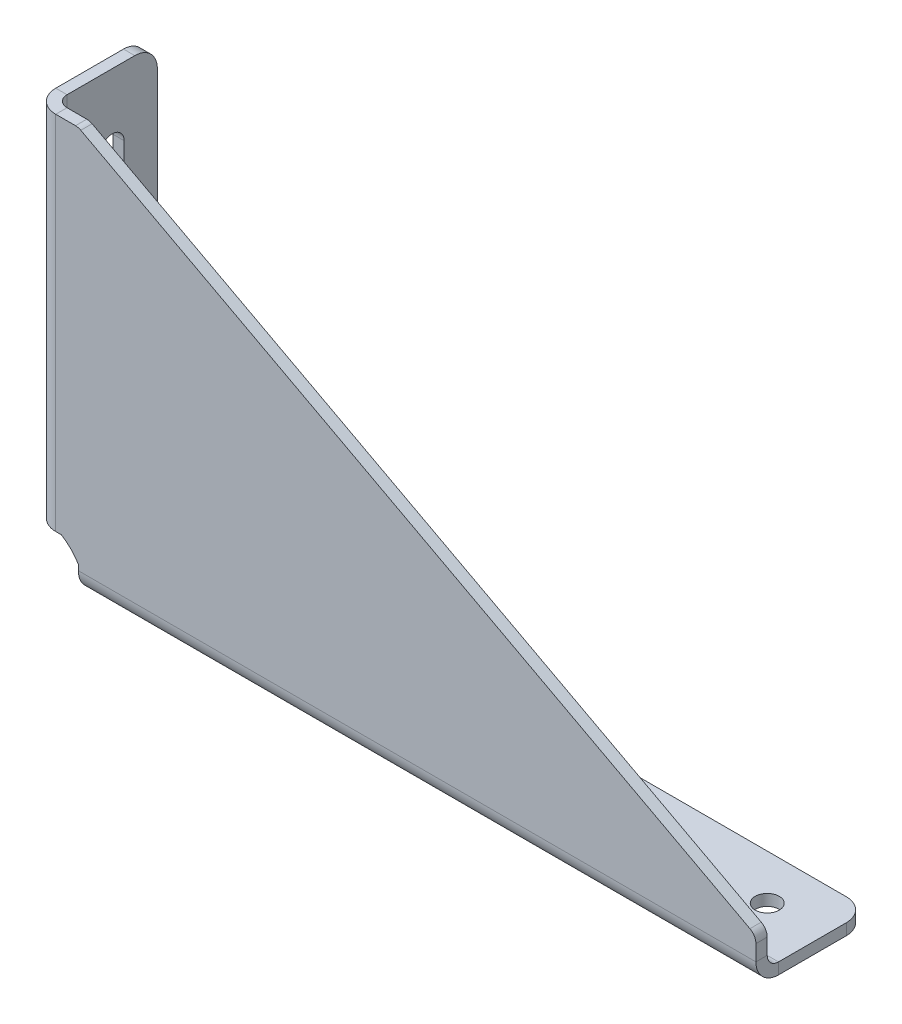
ISO-10303-21;
HEADER;
FILE_DESCRIPTION(('STEP AP214'),'2;1');
FILE_NAME('part.step','',(''),(''),'','','');
FILE_SCHEMA(('AUTOMOTIVE_DESIGN { 1 0 10303 214 1 1 1 1 }'));
ENDSEC;
DATA;
#1=APPLICATION_CONTEXT('core data for automotive mechanical design processes');
#2=APPLICATION_PROTOCOL_DEFINITION('international standard','automotive_design',2000,#1);
#3=PRODUCT_CONTEXT('',#1,'mechanical');
#4=PRODUCT('Part','Part','',(#3));
#5=PRODUCT_RELATED_PRODUCT_CATEGORY('part','',(#4));
#6=PRODUCT_DEFINITION_FORMATION('','',#4);
#7=PRODUCT_DEFINITION_CONTEXT('part definition',#1,'design');
#8=PRODUCT_DEFINITION('design','',#6,#7);
#9=PRODUCT_DEFINITION_SHAPE('','',#8);
#10=(LENGTH_UNIT() NAMED_UNIT(*) SI_UNIT(.MILLI.,.METRE.));
#11=(NAMED_UNIT(*) PLANE_ANGLE_UNIT() SI_UNIT($,.RADIAN.));
#12=(NAMED_UNIT(*) SI_UNIT($,.STERADIAN.) SOLID_ANGLE_UNIT());
#13=UNCERTAINTY_MEASURE_WITH_UNIT(LENGTH_MEASURE(1.E-05),#10,'distance_accuracy_value','');
#14=(GEOMETRIC_REPRESENTATION_CONTEXT(3) GLOBAL_UNCERTAINTY_ASSIGNED_CONTEXT((#13)) GLOBAL_UNIT_ASSIGNED_CONTEXT((#10,
#11,#12)) REPRESENTATION_CONTEXT('',''));
#15=CARTESIAN_POINT('',(0.,0.,0.));
#16=DIRECTION('',(0.,0.,1.));
#17=DIRECTION('',(1.,0.,0.));
#18=AXIS2_PLACEMENT_3D('',#15,#16,#17);
#19=CARTESIAN_POINT('',(0.,0.,3.175));
#20=DIRECTION('',(0.,0.,1.));
#21=DIRECTION('',(-1.,0.,0.));
#22=AXIS2_PLACEMENT_3D('',#19,#20,#21);
#23=PLANE('',#22);
#24=DIRECTION('',(-1.,0.,0.));
#25=VECTOR('',#24,1.);
#26=CARTESIAN_POINT('',(0.,114.3,3.175));
#27=LINE('',#26,#25);
#28=CARTESIAN_POINT('',(11.90625,114.3,3.175));
#29=VERTEX_POINT('',#28);
#30=CARTESIAN_POINT('',(6.35,114.3,3.175));
#31=VERTEX_POINT('',#30);
#32=EDGE_CURVE('E503',#29,#31,#27,.T.);
#33=ORIENTED_EDGE('',*,*,#32,.T.);
#34=DIRECTION('',(0.,-1.,0.));
#35=VECTOR('',#34,1.);
#36=CARTESIAN_POINT('',(6.35,12.7,3.17500000000001));
#37=LINE('',#36,#35);
#38=CARTESIAN_POINT('',(6.35,12.7,3.17500000000001));
#39=VERTEX_POINT('',#38);
#40=EDGE_CURVE('E415',#39,#31,#37,.F.);
#41=ORIENTED_EDGE('',*,*,#40,.F.);
#42=DIRECTION('',(-1.,0.,0.));
#43=VECTOR('',#42,1.);
#44=CARTESIAN_POINT('',(0.,12.7,3.175));
#45=LINE('',#44,#43);
#46=CARTESIAN_POINT('',(7.93749999999999,12.7,3.175));
#47=VERTEX_POINT('',#46);
#48=EDGE_CURVE('E490',#47,#39,#45,.T.);
#49=ORIENTED_EDGE('',*,*,#48,.F.);
#50=CARTESIAN_POINT('',(0.,0.,3.175));
#51=DIRECTION('',(0.,0.,1.));
#52=DIRECTION('',(1.,0.,0.));
#53=AXIS2_PLACEMENT_3D('',#50,#51,#52);
#54=CIRCLE('',#53,14.9764450471398);
#55=CARTESIAN_POINT('',(12.7,7.9375,3.175));
#56=VERTEX_POINT('',#55);
#57=EDGE_CURVE('E363',#56,#47,#54,.T.);
#58=ORIENTED_EDGE('',*,*,#57,.F.);
#59=DIRECTION('',(0.,1.,0.));
#60=VECTOR('',#59,1.);
#61=CARTESIAN_POINT('',(12.7,0.,3.175));
#62=LINE('',#61,#60);
#63=CARTESIAN_POINT('',(12.7,6.34999999999997,3.175));
#64=VERTEX_POINT('',#63);
#65=EDGE_CURVE('E498',#64,#56,#62,.T.);
#66=ORIENTED_EDGE('',*,*,#65,.F.);
#67=DIRECTION('',(1.,0.,0.));
#68=VECTOR('',#67,1.);
#69=CARTESIAN_POINT('',(203.2,6.35000000000002,3.175));
#70=LINE('',#69,#68);
#71=CARTESIAN_POINT('',(203.2,6.35000000000002,3.175));
#72=VERTEX_POINT('',#71);
#73=EDGE_CURVE('E465',#72,#64,#70,.F.);
#74=ORIENTED_EDGE('',*,*,#73,.F.);
#75=DIRECTION('',(0.,1.,0.));
#76=VECTOR('',#75,1.);
#77=CARTESIAN_POINT('',(203.2,12.7,3.175));
#78=LINE('',#77,#76);
#79=CARTESIAN_POINT('',(203.2,10.795,3.175));
#80=VERTEX_POINT('',#79);
#81=EDGE_CURVE('E506',#72,#80,#78,.T.);
#82=ORIENTED_EDGE('',*,*,#81,.T.);
#83=CARTESIAN_POINT('',(200.025,10.795,3.175));
#84=DIRECTION('',(0.,0.,-1.));
#85=DIRECTION('',(-1.,0.,0.));
#86=AXIS2_PLACEMENT_3D('',#83,#84,#85);
#87=CIRCLE('',#86,3.175);
#88=CARTESIAN_POINT('',(201.519117647059,13.5964705882353,3.175));
#89=VERTEX_POINT('',#88);
#90=EDGE_CURVE('E532',#89,#80,#87,.T.);
#91=ORIENTED_EDGE('',*,*,#90,.F.);
#92=DIRECTION('',(-0.88235294117647,0.470588235294118,0.));
#93=VECTOR('',#92,1.);
#94=CARTESIAN_POINT('',(12.7,114.3,3.175));
#95=LINE('',#94,#93);
#96=CARTESIAN_POINT('',(13.4003676470588,113.926470588235,3.175));
#97=VERTEX_POINT('',#96);
#98=EDGE_CURVE('E510',#89,#97,#95,.T.);
#99=ORIENTED_EDGE('',*,*,#98,.T.);
#100=CARTESIAN_POINT('',(11.90625,111.125,3.175));
#101=DIRECTION('',(0.,0.,-1.));
#102=DIRECTION('',(-1.,0.,0.));
#103=AXIS2_PLACEMENT_3D('',#100,#101,#102);
#104=CIRCLE('',#103,3.175);
#105=EDGE_CURVE('E535',#29,#97,#104,.T.);
#106=ORIENTED_EDGE('',*,*,#105,.F.);
#107=EDGE_LOOP('',(#33,#41,#49,#58,#66,#74,#82,#91,#99,#106));
#108=FACE_BOUND('',#107,.T.);
#109=ADVANCED_FACE('F156',(#108),#23,.T.);
#110=CARTESIAN_POINT('',(0.,0.,0.));
#111=DIRECTION('',(0.,0.,1.));
#112=DIRECTION('',(-1.,0.,0.));
#113=AXIS2_PLACEMENT_3D('',#110,#111,#112);
#114=PLANE('',#113);
#115=DIRECTION('',(-0.88235294117647,0.470588235294118,0.));
#116=VECTOR('',#115,1.);
#117=CARTESIAN_POINT('',(12.7,114.3,0.));
#118=LINE('',#117,#116);
#119=CARTESIAN_POINT('',(201.519117647059,13.5964705882353,0.));
#120=VERTEX_POINT('',#119);
#121=CARTESIAN_POINT('',(13.4003676470588,113.926470588235,0.));
#122=VERTEX_POINT('',#121);
#123=EDGE_CURVE('E507',#120,#122,#118,.T.);
#124=ORIENTED_EDGE('',*,*,#123,.F.);
#125=CARTESIAN_POINT('',(200.025,10.795,0.));
#126=DIRECTION('',(0.,0.,-1.));
#127=DIRECTION('',(-1.,0.,0.));
#128=AXIS2_PLACEMENT_3D('',#125,#126,#127);
#129=CIRCLE('',#128,3.175);
#130=CARTESIAN_POINT('',(203.2,10.795,0.));
#131=VERTEX_POINT('',#130);
#132=EDGE_CURVE('E524',#131,#120,#129,.F.);
#133=ORIENTED_EDGE('',*,*,#132,.F.);
#134=DIRECTION('',(0.,1.,0.));
#135=VECTOR('',#134,1.);
#136=CARTESIAN_POINT('',(203.2,12.7,0.));
#137=LINE('',#136,#135);
#138=CARTESIAN_POINT('',(203.2,6.35000000000003,0.));
#139=VERTEX_POINT('',#138);
#140=EDGE_CURVE('E516',#139,#131,#137,.T.);
#141=ORIENTED_EDGE('',*,*,#140,.F.);
#142=DIRECTION('',(1.,0.,0.));
#143=VECTOR('',#142,1.);
#144=CARTESIAN_POINT('',(203.2,6.35000000000003,0.));
#145=LINE('',#144,#143);
#146=CARTESIAN_POINT('',(12.7,6.34999999999997,0.));
#147=VERTEX_POINT('',#146);
#148=EDGE_CURVE('E477',#139,#147,#145,.F.);
#149=ORIENTED_EDGE('',*,*,#148,.T.);
#150=DIRECTION('',(0.,1.,0.));
#151=VECTOR('',#150,1.);
#152=CARTESIAN_POINT('',(12.7,6.34999999999997,0.));
#153=LINE('',#152,#151);
#154=CARTESIAN_POINT('',(12.7,7.9375,0.));
#155=VERTEX_POINT('',#154);
#156=EDGE_CURVE('E495',#147,#155,#153,.T.);
#157=ORIENTED_EDGE('',*,*,#156,.T.);
#158=CARTESIAN_POINT('',(0.,0.,0.));
#159=DIRECTION('',(0.,0.,1.));
#160=DIRECTION('',(-1.,0.,0.));
#161=AXIS2_PLACEMENT_3D('',#158,#159,#160);
#162=CIRCLE('',#161,14.9764450471398);
#163=CARTESIAN_POINT('',(7.93749999999999,12.7,0.));
#164=VERTEX_POINT('',#163);
#165=EDGE_CURVE('E362',#155,#164,#162,.T.);
#166=ORIENTED_EDGE('',*,*,#165,.T.);
#167=DIRECTION('',(-1.,0.,0.));
#168=VECTOR('',#167,1.);
#169=CARTESIAN_POINT('',(7.93749999999999,12.7,0.));
#170=LINE('',#169,#168);
#171=CARTESIAN_POINT('',(6.34999999999999,12.7,0.));
#172=VERTEX_POINT('',#171);
#173=EDGE_CURVE('E487',#164,#172,#170,.T.);
#174=ORIENTED_EDGE('',*,*,#173,.T.);
#175=DIRECTION('',(0.,-1.,0.));
#176=VECTOR('',#175,1.);
#177=CARTESIAN_POINT('',(6.34999999999999,12.7,0.));
#178=LINE('',#177,#176);
#179=CARTESIAN_POINT('',(6.35,114.3,0.));
#180=VERTEX_POINT('',#179);
#181=EDGE_CURVE('E427',#172,#180,#178,.F.);
#182=ORIENTED_EDGE('',*,*,#181,.T.);
#183=DIRECTION('',(-1.,0.,0.));
#184=VECTOR('',#183,1.);
#185=CARTESIAN_POINT('',(0.,114.3,0.));
#186=LINE('',#185,#184);
#187=CARTESIAN_POINT('',(11.90625,114.3,0.));
#188=VERTEX_POINT('',#187);
#189=EDGE_CURVE('E502',#188,#180,#186,.T.);
#190=ORIENTED_EDGE('',*,*,#189,.F.);
#191=CARTESIAN_POINT('',(11.90625,111.125,0.));
#192=DIRECTION('',(0.,0.,-1.));
#193=DIRECTION('',(-1.,0.,0.));
#194=AXIS2_PLACEMENT_3D('',#191,#192,#193);
#195=CIRCLE('',#194,3.175);
#196=EDGE_CURVE('E527',#122,#188,#195,.F.);
#197=ORIENTED_EDGE('',*,*,#196,.F.);
#198=EDGE_LOOP('',(#124,#133,#141,#149,#157,#166,#174,#182,#190,#197));
#199=FACE_BOUND('',#198,.T.);
#200=ADVANCED_FACE('F598',(#199),#114,.F.);
#201=CARTESIAN_POINT('',(203.2,12.7,3.175));
#202=DIRECTION('',(1.,0.,0.));
#203=DIRECTION('',(0.,1.,0.));
#204=AXIS2_PLACEMENT_3D('',#201,#202,#203);
#205=PLANE('',#204);
#206=ORIENTED_EDGE('',*,*,#81,.F.);
#207=DIRECTION('',(0.,0.,1.));
#208=VECTOR('',#207,1.);
#209=CARTESIAN_POINT('',(203.2,6.35000000000003,0.));
#210=LINE('',#209,#208);
#211=EDGE_CURVE('E472',#139,#72,#210,.T.);
#212=ORIENTED_EDGE('',*,*,#211,.F.);
#213=ORIENTED_EDGE('',*,*,#140,.T.);
#214=DIRECTION('',(0.,0.,-1.));
#215=VECTOR('',#214,1.);
#216=CARTESIAN_POINT('',(203.2,10.795,3.175));
#217=LINE('',#216,#215);
#218=EDGE_CURVE('E538',#80,#131,#217,.T.);
#219=ORIENTED_EDGE('',*,*,#218,.F.);
#220=EDGE_LOOP('',(#206,#212,#213,#219));
#221=FACE_BOUND('',#220,.T.);
#222=ADVANCED_FACE('F604',(#221),#205,.T.);
#223=CARTESIAN_POINT('',(0.,114.3,3.175));
#224=DIRECTION('',(0.,1.,0.));
#225=DIRECTION('',(0.,0.,-1.));
#226=AXIS2_PLACEMENT_3D('',#223,#224,#225);
#227=PLANE('',#226);
#228=ORIENTED_EDGE('',*,*,#189,.T.);
#229=DIRECTION('',(0.,0.,1.));
#230=VECTOR('',#229,1.);
#231=CARTESIAN_POINT('',(6.35,114.3,0.));
#232=LINE('',#231,#230);
#233=EDGE_CURVE('E431',#180,#31,#232,.T.);
#234=ORIENTED_EDGE('',*,*,#233,.T.);
#235=ORIENTED_EDGE('',*,*,#32,.F.);
#236=DIRECTION('',(0.,0.,-1.));
#237=VECTOR('',#236,1.);
#238=CARTESIAN_POINT('',(11.90625,114.3,3.175));
#239=LINE('',#238,#237);
#240=EDGE_CURVE('E530',#188,#29,#239,.F.);
#241=ORIENTED_EDGE('',*,*,#240,.F.);
#242=EDGE_LOOP('',(#228,#234,#235,#241));
#243=FACE_BOUND('',#242,.T.);
#244=ADVANCED_FACE('F614',(#243),#227,.T.);
#245=CARTESIAN_POINT('',(12.7,114.3,3.175));
#246=DIRECTION('',(0.470588235294118,0.882352941176471,0.));
#247=DIRECTION('',(-0.882352941176471,0.470588235294118,0.));
#248=AXIS2_PLACEMENT_3D('',#245,#246,#247);
#249=PLANE('',#248);
#250=ORIENTED_EDGE('',*,*,#98,.F.);
#251=DIRECTION('',(0.,0.,-1.));
#252=VECTOR('',#251,1.);
#253=CARTESIAN_POINT('',(201.519117647059,13.5964705882353,3.175));
#254=LINE('',#253,#252);
#255=EDGE_CURVE('E513',#120,#89,#254,.F.);
#256=ORIENTED_EDGE('',*,*,#255,.F.);
#257=ORIENTED_EDGE('',*,*,#123,.T.);
#258=DIRECTION('',(0.,0.,-1.));
#259=VECTOR('',#258,1.);
#260=CARTESIAN_POINT('',(13.4003676470588,113.926470588235,3.175));
#261=LINE('',#260,#259);
#262=EDGE_CURVE('E522',#97,#122,#261,.T.);
#263=ORIENTED_EDGE('',*,*,#262,.F.);
#264=EDGE_LOOP('',(#250,#256,#257,#263));
#265=FACE_BOUND('',#264,.T.);
#266=ADVANCED_FACE('F611',(#265),#249,.T.);
#267=CARTESIAN_POINT('',(12.7,6.34999999999997,0.));
#268=DIRECTION('',(-1.,0.,0.));
#269=DIRECTION('',(0.,0.,-1.));
#270=AXIS2_PLACEMENT_3D('',#267,#268,#269);
#271=PLANE('',#270);
#272=ORIENTED_EDGE('',*,*,#65,.T.);
#273=DIRECTION('',(0.,0.,1.));
#274=VECTOR('',#273,1.);
#275=CARTESIAN_POINT('',(12.7,7.93749999999997,0.));
#276=LINE('',#275,#274);
#277=EDGE_CURVE('E494',#155,#56,#276,.T.);
#278=ORIENTED_EDGE('',*,*,#277,.F.);
#279=ORIENTED_EDGE('',*,*,#156,.F.);
#280=DIRECTION('',(0.,0.,1.));
#281=VECTOR('',#280,1.);
#282=CARTESIAN_POINT('',(12.7,6.34999999999997,0.));
#283=LINE('',#282,#281);
#284=EDGE_CURVE('E481',#147,#64,#283,.T.);
#285=ORIENTED_EDGE('',*,*,#284,.T.);
#286=EDGE_LOOP('',(#272,#278,#279,#285));
#287=FACE_BOUND('',#286,.T.);
#288=ADVANCED_FACE('F608',(#287),#271,.T.);
#289=CARTESIAN_POINT('',(7.93749999999999,12.7,0.));
#290=DIRECTION('',(0.,-1.,0.));
#291=DIRECTION('',(0.,0.,1.));
#292=AXIS2_PLACEMENT_3D('',#289,#290,#291);
#293=PLANE('',#292);
#294=ORIENTED_EDGE('',*,*,#48,.T.);
#295=DIRECTION('',(0.,0.,1.));
#296=VECTOR('',#295,1.);
#297=CARTESIAN_POINT('',(6.34999999999999,12.7,0.));
#298=LINE('',#297,#296);
#299=EDGE_CURVE('E422',#172,#39,#298,.T.);
#300=ORIENTED_EDGE('',*,*,#299,.F.);
#301=ORIENTED_EDGE('',*,*,#173,.F.);
#302=DIRECTION('',(0.,0.,1.));
#303=VECTOR('',#302,1.);
#304=CARTESIAN_POINT('',(7.93749999999999,12.7,0.));
#305=LINE('',#304,#303);
#306=EDGE_CURVE('E484',#164,#47,#305,.T.);
#307=ORIENTED_EDGE('',*,*,#306,.T.);
#308=EDGE_LOOP('',(#294,#300,#301,#307));
#309=FACE_BOUND('',#308,.T.);
#310=ADVANCED_FACE('F677',(#309),#293,.T.);
#311=CARTESIAN_POINT('',(12.7,6.34999999999998,-3.175));
#312=DIRECTION('',(-1.,0.,0.));
#313=DIRECTION('',(0.,-1.,0.));
#314=AXIS2_PLACEMENT_3D('',#311,#312,#313);
#315=PLANE('',#314);
#316=DIRECTION('',(0.,-1.,0.));
#317=VECTOR('',#316,1.);
#318=CARTESIAN_POINT('',(12.7,0.,-3.17499999999998));
#319=LINE('',#318,#317);
#320=CARTESIAN_POINT('',(12.7,3.17499999999999,-3.17499999999999));
#321=VERTEX_POINT('',#320);
#322=CARTESIAN_POINT('',(12.7,0.,-3.17499999999998));
#323=VERTEX_POINT('',#322);
#324=EDGE_CURVE('E434',#321,#323,#319,.T.);
#325=ORIENTED_EDGE('',*,*,#324,.T.);
#326=CARTESIAN_POINT('',(12.7,6.34999999999998,-3.175));
#327=DIRECTION('',(-1.,0.,0.));
#328=DIRECTION('',(0.,1.,0.));
#329=AXIS2_PLACEMENT_3D('',#326,#327,#328);
#330=CIRCLE('',#329,6.34999999999999);
#331=EDGE_CURVE('E468',#64,#323,#330,.F.);
#332=ORIENTED_EDGE('',*,*,#331,.F.);
#333=ORIENTED_EDGE('',*,*,#284,.F.);
#334=CARTESIAN_POINT('',(12.7,6.34999999999998,-3.175));
#335=DIRECTION('',(-1.,0.,0.));
#336=DIRECTION('',(0.,1.,0.));
#337=AXIS2_PLACEMENT_3D('',#334,#335,#336);
#338=CIRCLE('',#337,3.17499999999999);
#339=EDGE_CURVE('E474',#147,#321,#338,.F.);
#340=ORIENTED_EDGE('',*,*,#339,.T.);
#341=EDGE_LOOP('',(#325,#332,#333,#340));
#342=FACE_BOUND('',#341,.T.);
#343=ADVANCED_FACE('F712',(#342),#315,.T.);
#344=CARTESIAN_POINT('',(203.2,6.35000000000003,-3.17499999999999));
#345=DIRECTION('',(-1.,0.,0.));
#346=DIRECTION('',(0.,-1.,0.));
#347=AXIS2_PLACEMENT_3D('',#344,#345,#346);
#348=PLANE('',#347);
#349=CARTESIAN_POINT('',(203.2,6.35000000000003,-3.17499999999999));
#350=DIRECTION('',(-1.,0.,0.));
#351=DIRECTION('',(0.,1.,0.));
#352=AXIS2_PLACEMENT_3D('',#349,#350,#351);
#353=CIRCLE('',#352,3.17499999999999);
#354=CARTESIAN_POINT('',(203.2,3.17500000000004,-3.17499999999998));
#355=VERTEX_POINT('',#354);
#356=EDGE_CURVE('E439',#355,#139,#353,.T.);
#357=ORIENTED_EDGE('',*,*,#356,.T.);
#358=ORIENTED_EDGE('',*,*,#211,.T.);
#359=CARTESIAN_POINT('',(203.2,6.35000000000003,-3.17499999999999));
#360=DIRECTION('',(-1.,0.,0.));
#361=DIRECTION('',(0.,1.,0.));
#362=AXIS2_PLACEMENT_3D('',#359,#360,#361);
#363=CIRCLE('',#362,6.34999999999999);
#364=CARTESIAN_POINT('',(203.2,0.,-3.17499999999997));
#365=VERTEX_POINT('',#364);
#366=EDGE_CURVE('E469',#365,#72,#363,.T.);
#367=ORIENTED_EDGE('',*,*,#366,.F.);
#368=DIRECTION('',(0.,-1.,0.));
#369=VECTOR('',#368,1.);
#370=CARTESIAN_POINT('',(203.2,3.17500000000002,-3.17499999999998));
#371=LINE('',#370,#369);
#372=EDGE_CURVE('E457',#355,#365,#371,.T.);
#373=ORIENTED_EDGE('',*,*,#372,.F.);
#374=EDGE_LOOP('',(#357,#358,#367,#373));
#375=FACE_BOUND('',#374,.T.);
#376=ADVANCED_FACE('F701',(#375),#348,.F.);
#377=CARTESIAN_POINT('',(203.2,6.35000000000003,-3.17499999999999));
#378=DIRECTION('',(1.,0.,0.));
#379=DIRECTION('',(0.,-1.,0.));
#380=AXIS2_PLACEMENT_3D('',#377,#378,#379);
#381=CYLINDRICAL_SURFACE('',#380,6.34999999999999);
#382=ORIENTED_EDGE('',*,*,#73,.T.);
#383=ORIENTED_EDGE('',*,*,#331,.T.);
#384=DIRECTION('',(1.,0.,0.));
#385=VECTOR('',#384,1.);
#386=CARTESIAN_POINT('',(12.7,0.,-3.17499999999998));
#387=LINE('',#386,#385);
#388=EDGE_CURVE('E454',#365,#323,#387,.F.);
#389=ORIENTED_EDGE('',*,*,#388,.F.);
#390=ORIENTED_EDGE('',*,*,#366,.T.);
#391=EDGE_LOOP('',(#382,#383,#389,#390));
#392=FACE_BOUND('',#391,.T.);
#393=ADVANCED_FACE('F694',(#392),#381,.T.);
#394=CARTESIAN_POINT('',(203.2,6.35000000000003,-3.17499999999999));
#395=DIRECTION('',(1.,0.,0.));
#396=DIRECTION('',(0.,-1.,0.));
#397=AXIS2_PLACEMENT_3D('',#394,#395,#396);
#398=CYLINDRICAL_SURFACE('',#397,3.17499999999999);
#399=ORIENTED_EDGE('',*,*,#148,.F.);
#400=ORIENTED_EDGE('',*,*,#356,.F.);
#401=DIRECTION('',(1.,0.,0.));
#402=VECTOR('',#401,1.);
#403=CARTESIAN_POINT('',(12.7,3.17499999999999,-3.17499999999999));
#404=LINE('',#403,#402);
#405=EDGE_CURVE('E460',#321,#355,#404,.T.);
#406=ORIENTED_EDGE('',*,*,#405,.F.);
#407=ORIENTED_EDGE('',*,*,#339,.F.);
#408=EDGE_LOOP('',(#399,#400,#406,#407));
#409=FACE_BOUND('',#408,.T.);
#410=ADVANCED_FACE('F709',(#409),#398,.F.);
#411=CARTESIAN_POINT('',(12.7,0.,0.));
#412=DIRECTION('',(-1.,0.,0.));
#413=DIRECTION('',(0.,-1.,0.));
#414=AXIS2_PLACEMENT_3D('',#411,#412,#413);
#415=PLANE('',#414);
#416=DIRECTION('',(0.,0.,1.));
#417=VECTOR('',#416,1.);
#418=CARTESIAN_POINT('',(12.7,0.,0.));
#419=LINE('',#418,#417);
#420=CARTESIAN_POINT('',(12.7,0.,-22.225));
#421=VERTEX_POINT('',#420);
#422=EDGE_CURVE('E443',#323,#421,#419,.F.);
#423=ORIENTED_EDGE('',*,*,#422,.F.);
#424=ORIENTED_EDGE('',*,*,#324,.F.);
#425=DIRECTION('',(0.,0.,-1.));
#426=VECTOR('',#425,1.);
#427=CARTESIAN_POINT('',(12.7,3.175,0.));
#428=LINE('',#427,#426);
#429=CARTESIAN_POINT('',(12.7,3.17499999999992,-22.225));
#430=VERTEX_POINT('',#429);
#431=EDGE_CURVE('E451',#321,#430,#428,.T.);
#432=ORIENTED_EDGE('',*,*,#431,.T.);
#433=DIRECTION('',(0.,1.,0.));
#434=VECTOR('',#433,1.);
#435=CARTESIAN_POINT('',(12.7,0.,-22.225));
#436=LINE('',#435,#434);
#437=EDGE_CURVE('E557',#421,#430,#436,.T.);
#438=ORIENTED_EDGE('',*,*,#437,.F.);
#439=EDGE_LOOP('',(#423,#424,#432,#438));
#440=FACE_BOUND('',#439,.T.);
#441=ADVANCED_FACE('F714',(#440),#415,.T.);
#442=CARTESIAN_POINT('',(203.2,0.,-28.575));
#443=DIRECTION('',(1.,0.,0.));
#444=DIRECTION('',(0.,1.,0.));
#445=AXIS2_PLACEMENT_3D('',#442,#443,#444);
#446=PLANE('',#445);
#447=DIRECTION('',(0.,0.,1.));
#448=VECTOR('',#447,1.);
#449=CARTESIAN_POINT('',(203.2,3.17500000000004,0.));
#450=LINE('',#449,#448);
#451=CARTESIAN_POINT('',(203.2,3.17499999999996,-22.225));
#452=VERTEX_POINT('',#451);
#453=EDGE_CURVE('E446',#452,#355,#450,.T.);
#454=ORIENTED_EDGE('',*,*,#453,.T.);
#455=ORIENTED_EDGE('',*,*,#372,.T.);
#456=DIRECTION('',(0.,0.,-1.));
#457=VECTOR('',#456,1.);
#458=CARTESIAN_POINT('',(203.2,0.,-28.575));
#459=LINE('',#458,#457);
#460=CARTESIAN_POINT('',(203.2,0.,-22.225));
#461=VERTEX_POINT('',#460);
#462=EDGE_CURVE('E437',#461,#365,#459,.F.);
#463=ORIENTED_EDGE('',*,*,#462,.F.);
#464=DIRECTION('',(0.,1.,0.));
#465=VECTOR('',#464,1.);
#466=CARTESIAN_POINT('',(203.2,0.,-22.225));
#467=LINE('',#466,#465);
#468=EDGE_CURVE('E549',#452,#461,#467,.F.);
#469=ORIENTED_EDGE('',*,*,#468,.F.);
#470=EDGE_LOOP('',(#454,#455,#463,#469));
#471=FACE_BOUND('',#470,.T.);
#472=ADVANCED_FACE('F722',(#471),#446,.T.);
#473=CARTESIAN_POINT('',(0.,0.,0.));
#474=DIRECTION('',(0.,1.,0.));
#475=DIRECTION('',(0.,0.,-1.));
#476=AXIS2_PLACEMENT_3D('',#473,#474,#475);
#477=PLANE('',#476);
#478=CARTESIAN_POINT('',(28.5749999999999,-1.40946282423116E-13,-15.875));
#479=DIRECTION('',(0.,-1.,0.));
#480=DIRECTION('',(0.,0.,-1.));
#481=AXIS2_PLACEMENT_3D('',#478,#479,#480);
#482=CIRCLE('',#481,3.3782);
#483=CARTESIAN_POINT('',(28.5749999999999,-1.52741204681995E-13,-19.2532));
#484=VERTEX_POINT('',#483);
#485=EDGE_CURVE('E377',#484,#484,#482,.T.);
#486=ORIENTED_EDGE('',*,*,#485,.F.);
#487=EDGE_LOOP('',(#486));
#488=FACE_BOUND('',#487,.T.);
#489=CARTESIAN_POINT('',(187.325,-1.40512601554121E-13,-15.875));
#490=DIRECTION('',(0.,-1.,0.));
#491=DIRECTION('',(0.,0.,-1.));
#492=AXIS2_PLACEMENT_3D('',#489,#490,#491);
#493=CIRCLE('',#492,3.3782);
#494=CARTESIAN_POINT('',(187.325,-1.52307523813001E-13,-19.2532));
#495=VERTEX_POINT('',#494);
#496=EDGE_CURVE('E383',#495,#495,#493,.T.);
#497=ORIENTED_EDGE('',*,*,#496,.F.);
#498=EDGE_LOOP('',(#497));
#499=FACE_BOUND('',#498,.T.);
#500=ORIENTED_EDGE('',*,*,#462,.T.);
#501=ORIENTED_EDGE('',*,*,#388,.T.);
#502=ORIENTED_EDGE('',*,*,#422,.T.);
#503=CARTESIAN_POINT('',(19.05,0.,-22.225));
#504=DIRECTION('',(0.,-1.,0.));
#505=DIRECTION('',(0.,0.,-1.));
#506=AXIS2_PLACEMENT_3D('',#503,#504,#505);
#507=CIRCLE('',#506,6.35);
#508=CARTESIAN_POINT('',(19.05,0.,-28.575));
#509=VERTEX_POINT('',#508);
#510=EDGE_CURVE('E552',#509,#421,#507,.F.);
#511=ORIENTED_EDGE('',*,*,#510,.F.);
#512=DIRECTION('',(-1.,0.,0.));
#513=VECTOR('',#512,1.);
#514=CARTESIAN_POINT('',(12.7,0.,-28.575));
#515=LINE('',#514,#513);
#516=CARTESIAN_POINT('',(196.85,0.,-28.575));
#517=VERTEX_POINT('',#516);
#518=EDGE_CURVE('E440',#509,#517,#515,.F.);
#519=ORIENTED_EDGE('',*,*,#518,.T.);
#520=CARTESIAN_POINT('',(196.85,0.,-22.225));
#521=DIRECTION('',(0.,-1.,0.));
#522=DIRECTION('',(0.,0.,-1.));
#523=AXIS2_PLACEMENT_3D('',#520,#521,#522);
#524=CIRCLE('',#523,6.35);
#525=EDGE_CURVE('E554',#461,#517,#524,.F.);
#526=ORIENTED_EDGE('',*,*,#525,.F.);
#527=EDGE_LOOP('',(#500,#501,#502,#511,#519,#526));
#528=FACE_BOUND('',#527,.T.);
#529=ADVANCED_FACE('F718',(#488,#499,#528),#477,.F.);
#530=CARTESIAN_POINT('',(0.,3.175,0.));
#531=DIRECTION('',(0.,1.,0.));
#532=DIRECTION('',(0.,0.,-1.));
#533=AXIS2_PLACEMENT_3D('',#530,#531,#532);
#534=PLANE('',#533);
#535=CARTESIAN_POINT('',(28.5749999999999,3.17499999999997,-15.875));
#536=DIRECTION('',(0.,-1.,0.));
#537=DIRECTION('',(0.,0.,-1.));
#538=AXIS2_PLACEMENT_3D('',#535,#536,#537);
#539=CIRCLE('',#538,3.3782);
#540=CARTESIAN_POINT('',(28.5749999999999,3.17499999999996,-19.2532));
#541=VERTEX_POINT('',#540);
#542=EDGE_CURVE('E374',#541,#541,#539,.T.);
#543=ORIENTED_EDGE('',*,*,#542,.T.);
#544=EDGE_LOOP('',(#543));
#545=FACE_BOUND('',#544,.T.);
#546=CARTESIAN_POINT('',(187.325,3.17499999999997,-15.875));
#547=DIRECTION('',(0.,-1.,0.));
#548=DIRECTION('',(0.,0.,-1.));
#549=AXIS2_PLACEMENT_3D('',#546,#547,#548);
#550=CIRCLE('',#549,3.3782);
#551=CARTESIAN_POINT('',(187.325,3.17499999999996,-19.2532));
#552=VERTEX_POINT('',#551);
#553=EDGE_CURVE('E380',#552,#552,#550,.T.);
#554=ORIENTED_EDGE('',*,*,#553,.T.);
#555=EDGE_LOOP('',(#554));
#556=FACE_BOUND('',#555,.T.);
#557=DIRECTION('',(1.,0.,0.));
#558=VECTOR('',#557,1.);
#559=CARTESIAN_POINT('',(0.,3.1749999999999,-28.575));
#560=LINE('',#559,#558);
#561=CARTESIAN_POINT('',(19.05,3.1749999999999,-28.575));
#562=VERTEX_POINT('',#561);
#563=CARTESIAN_POINT('',(196.85,3.17499999999993,-28.575));
#564=VERTEX_POINT('',#563);
#565=EDGE_CURVE('E448',#562,#564,#560,.T.);
#566=ORIENTED_EDGE('',*,*,#565,.F.);
#567=CARTESIAN_POINT('',(19.05,3.17499999999993,-22.225));
#568=DIRECTION('',(0.,-1.,0.));
#569=DIRECTION('',(0.,0.,-1.));
#570=AXIS2_PLACEMENT_3D('',#567,#568,#569);
#571=CIRCLE('',#570,6.35);
#572=EDGE_CURVE('E544',#430,#562,#571,.T.);
#573=ORIENTED_EDGE('',*,*,#572,.F.);
#574=ORIENTED_EDGE('',*,*,#431,.F.);
#575=ORIENTED_EDGE('',*,*,#405,.T.);
#576=ORIENTED_EDGE('',*,*,#453,.F.);
#577=CARTESIAN_POINT('',(196.85,3.17499999999996,-22.225));
#578=DIRECTION('',(0.,-1.,0.));
#579=DIRECTION('',(0.,0.,-1.));
#580=AXIS2_PLACEMENT_3D('',#577,#578,#579);
#581=CIRCLE('',#580,6.35);
#582=EDGE_CURVE('E547',#564,#452,#581,.T.);
#583=ORIENTED_EDGE('',*,*,#582,.F.);
#584=EDGE_LOOP('',(#566,#573,#574,#575,#576,#583));
#585=FACE_BOUND('',#584,.T.);
#586=ADVANCED_FACE('F727',(#545,#556,#585),#534,.T.);
#587=CARTESIAN_POINT('',(12.7,0.,-28.575));
#588=DIRECTION('',(0.,0.,-1.));
#589=DIRECTION('',(0.,-1.,0.));
#590=AXIS2_PLACEMENT_3D('',#587,#588,#589);
#591=PLANE('',#590);
#592=ORIENTED_EDGE('',*,*,#518,.F.);
#593=DIRECTION('',(0.,1.,0.));
#594=VECTOR('',#593,1.);
#595=CARTESIAN_POINT('',(19.05,0.,-28.575));
#596=LINE('',#595,#594);
#597=EDGE_CURVE('E540',#562,#509,#596,.F.);
#598=ORIENTED_EDGE('',*,*,#597,.F.);
#599=ORIENTED_EDGE('',*,*,#565,.T.);
#600=DIRECTION('',(0.,1.,0.));
#601=VECTOR('',#600,1.);
#602=CARTESIAN_POINT('',(196.85,0.,-28.575));
#603=LINE('',#602,#601);
#604=EDGE_CURVE('E542',#517,#564,#603,.T.);
#605=ORIENTED_EDGE('',*,*,#604,.F.);
#606=EDGE_LOOP('',(#592,#598,#599,#605));
#607=FACE_BOUND('',#606,.T.);
#608=ADVANCED_FACE('F730',(#607),#591,.T.);
#609=CARTESIAN_POINT('',(6.34999999999999,114.3,-3.175));
#610=DIRECTION('',(0.,1.,0.));
#611=DIRECTION('',(-1.,0.,0.));
#612=AXIS2_PLACEMENT_3D('',#609,#610,#611);
#613=PLANE('',#612);
#614=DIRECTION('',(-1.,0.,0.));
#615=VECTOR('',#614,1.);
#616=CARTESIAN_POINT('',(0.,114.3,-3.17499999999998));
#617=LINE('',#616,#615);
#618=CARTESIAN_POINT('',(3.17499999999999,114.3,-3.17499999999999));
#619=VERTEX_POINT('',#618);
#620=CARTESIAN_POINT('',(0.,114.3,-3.17499999999998));
#621=VERTEX_POINT('',#620);
#622=EDGE_CURVE('E386',#619,#621,#617,.T.);
#623=ORIENTED_EDGE('',*,*,#622,.T.);
#624=CARTESIAN_POINT('',(6.34999999999999,114.3,-3.175));
#625=DIRECTION('',(0.,1.,0.));
#626=DIRECTION('',(1.,0.,0.));
#627=AXIS2_PLACEMENT_3D('',#624,#625,#626);
#628=CIRCLE('',#627,6.35000000000001);
#629=EDGE_CURVE('E418',#31,#621,#628,.F.);
#630=ORIENTED_EDGE('',*,*,#629,.F.);
#631=ORIENTED_EDGE('',*,*,#233,.F.);
#632=CARTESIAN_POINT('',(6.34999999999999,114.3,-3.175));
#633=DIRECTION('',(0.,1.,0.));
#634=DIRECTION('',(1.,0.,0.));
#635=AXIS2_PLACEMENT_3D('',#632,#633,#634);
#636=CIRCLE('',#635,3.17500000000001);
#637=EDGE_CURVE('E424',#180,#619,#636,.F.);
#638=ORIENTED_EDGE('',*,*,#637,.T.);
#639=EDGE_LOOP('',(#623,#630,#631,#638));
#640=FACE_BOUND('',#639,.T.);
#641=ADVANCED_FACE('F664',(#640),#613,.T.);
#642=CARTESIAN_POINT('',(6.34999999999998,12.7,-3.175));
#643=DIRECTION('',(0.,1.,0.));
#644=DIRECTION('',(-1.,0.,0.));
#645=AXIS2_PLACEMENT_3D('',#642,#643,#644);
#646=PLANE('',#645);
#647=CARTESIAN_POINT('',(6.34999999999998,12.7,-3.175));
#648=DIRECTION('',(0.,1.,0.));
#649=DIRECTION('',(1.,0.,0.));
#650=AXIS2_PLACEMENT_3D('',#647,#648,#649);
#651=CIRCLE('',#650,3.17500000000001);
#652=CARTESIAN_POINT('',(3.17499999999997,12.7,-3.17499999999999));
#653=VERTEX_POINT('',#652);
#654=EDGE_CURVE('E389',#653,#172,#651,.T.);
#655=ORIENTED_EDGE('',*,*,#654,.T.);
#656=ORIENTED_EDGE('',*,*,#299,.T.);
#657=CARTESIAN_POINT('',(6.34999999999998,12.7,-3.175));
#658=DIRECTION('',(0.,1.,0.));
#659=DIRECTION('',(1.,0.,0.));
#660=AXIS2_PLACEMENT_3D('',#657,#658,#659);
#661=CIRCLE('',#660,6.35000000000001);
#662=CARTESIAN_POINT('',(0.,12.7,-3.17499999999998));
#663=VERTEX_POINT('',#662);
#664=EDGE_CURVE('E419',#663,#39,#661,.T.);
#665=ORIENTED_EDGE('',*,*,#664,.F.);
#666=DIRECTION('',(-1.,0.,0.));
#667=VECTOR('',#666,1.);
#668=CARTESIAN_POINT('',(3.17499999999999,12.7,-3.17499999999999));
#669=LINE('',#668,#667);
#670=EDGE_CURVE('E407',#653,#663,#669,.T.);
#671=ORIENTED_EDGE('',*,*,#670,.F.);
#672=EDGE_LOOP('',(#655,#656,#665,#671));
#673=FACE_BOUND('',#672,.T.);
#674=ADVANCED_FACE('F674',(#673),#646,.F.);
#675=CARTESIAN_POINT('',(6.34999999999998,12.7,-3.175));
#676=DIRECTION('',(0.,-1.,0.));
#677=DIRECTION('',(-1.,0.,0.));
#678=AXIS2_PLACEMENT_3D('',#675,#676,#677);
#679=CYLINDRICAL_SURFACE('',#678,6.35000000000001);
#680=ORIENTED_EDGE('',*,*,#40,.T.);
#681=ORIENTED_EDGE('',*,*,#629,.T.);
#682=DIRECTION('',(0.,-1.,0.));
#683=VECTOR('',#682,1.);
#684=CARTESIAN_POINT('',(0.,114.3,-3.17499999999998));
#685=LINE('',#684,#683);
#686=EDGE_CURVE('E404',#663,#621,#685,.F.);
#687=ORIENTED_EDGE('',*,*,#686,.F.);
#688=ORIENTED_EDGE('',*,*,#664,.T.);
#689=EDGE_LOOP('',(#680,#681,#687,#688));
#690=FACE_BOUND('',#689,.T.);
#691=ADVANCED_FACE('F659',(#690),#679,.T.);
#692=CARTESIAN_POINT('',(6.34999999999998,12.7,-3.175));
#693=DIRECTION('',(0.,-1.,0.));
#694=DIRECTION('',(-1.,0.,0.));
#695=AXIS2_PLACEMENT_3D('',#692,#693,#694);
#696=CYLINDRICAL_SURFACE('',#695,3.17500000000001);
#697=ORIENTED_EDGE('',*,*,#181,.F.);
#698=ORIENTED_EDGE('',*,*,#654,.F.);
#699=DIRECTION('',(0.,-1.,0.));
#700=VECTOR('',#699,1.);
#701=CARTESIAN_POINT('',(3.17499999999999,114.3,-3.17499999999999));
#702=LINE('',#701,#700);
#703=EDGE_CURVE('E410',#619,#653,#702,.T.);
#704=ORIENTED_EDGE('',*,*,#703,.F.);
#705=ORIENTED_EDGE('',*,*,#637,.F.);
#706=EDGE_LOOP('',(#697,#698,#704,#705));
#707=FACE_BOUND('',#706,.T.);
#708=ADVANCED_FACE('F671',(#707),#696,.F.);
#709=CARTESIAN_POINT('',(0.,114.3,0.));
#710=DIRECTION('',(0.,1.,0.));
#711=DIRECTION('',(0.,0.,-1.));
#712=AXIS2_PLACEMENT_3D('',#709,#710,#711);
#713=PLANE('',#712);
#714=DIRECTION('',(0.,0.,1.));
#715=VECTOR('',#714,1.);
#716=CARTESIAN_POINT('',(0.,114.3,0.));
#717=LINE('',#716,#715);
#718=CARTESIAN_POINT('',(0.,114.3,-22.225));
#719=VERTEX_POINT('',#718);
#720=EDGE_CURVE('E393',#621,#719,#717,.F.);
#721=ORIENTED_EDGE('',*,*,#720,.F.);
#722=ORIENTED_EDGE('',*,*,#622,.F.);
#723=DIRECTION('',(0.,0.,-1.));
#724=VECTOR('',#723,1.);
#725=CARTESIAN_POINT('',(3.175,114.3,0.));
#726=LINE('',#725,#724);
#727=CARTESIAN_POINT('',(3.17499999999992,114.3,-22.225));
#728=VERTEX_POINT('',#727);
#729=EDGE_CURVE('E401',#619,#728,#726,.T.);
#730=ORIENTED_EDGE('',*,*,#729,.T.);
#731=DIRECTION('',(1.,0.,0.));
#732=VECTOR('',#731,1.);
#733=CARTESIAN_POINT('',(0.,114.3,-22.225));
#734=LINE('',#733,#732);
#735=EDGE_CURVE('E575',#719,#728,#734,.T.);
#736=ORIENTED_EDGE('',*,*,#735,.F.);
#737=EDGE_LOOP('',(#721,#722,#730,#736));
#738=FACE_BOUND('',#737,.T.);
#739=ADVANCED_FACE('F666',(#738),#713,.T.);
#740=CARTESIAN_POINT('',(0.,12.7,-28.575));
#741=DIRECTION('',(0.,-1.,0.));
#742=DIRECTION('',(0.,0.,1.));
#743=AXIS2_PLACEMENT_3D('',#740,#741,#742);
#744=PLANE('',#743);
#745=DIRECTION('',(0.,0.,1.));
#746=VECTOR('',#745,1.);
#747=CARTESIAN_POINT('',(3.175,12.7,0.));
#748=LINE('',#747,#746);
#749=CARTESIAN_POINT('',(3.17499999999992,12.7,-22.225));
#750=VERTEX_POINT('',#749);
#751=EDGE_CURVE('E396',#750,#653,#748,.T.);
#752=ORIENTED_EDGE('',*,*,#751,.T.);
#753=ORIENTED_EDGE('',*,*,#670,.T.);
#754=DIRECTION('',(0.,0.,-1.));
#755=VECTOR('',#754,1.);
#756=CARTESIAN_POINT('',(0.,12.7,-28.575));
#757=LINE('',#756,#755);
#758=CARTESIAN_POINT('',(0.,12.7,-22.225));
#759=VERTEX_POINT('',#758);
#760=EDGE_CURVE('E387',#759,#663,#757,.F.);
#761=ORIENTED_EDGE('',*,*,#760,.F.);
#762=DIRECTION('',(1.,0.,0.));
#763=VECTOR('',#762,1.);
#764=CARTESIAN_POINT('',(0.,12.7,-22.225));
#765=LINE('',#764,#763);
#766=EDGE_CURVE('E569',#750,#759,#765,.F.);
#767=ORIENTED_EDGE('',*,*,#766,.F.);
#768=EDGE_LOOP('',(#752,#753,#761,#767));
#769=FACE_BOUND('',#768,.T.);
#770=ADVANCED_FACE('F654',(#769),#744,.T.);
#771=CARTESIAN_POINT('',(0.,0.,0.));
#772=DIRECTION('',(1.,0.,0.));
#773=DIRECTION('',(0.,0.,1.));
#774=AXIS2_PLACEMENT_3D('',#771,#772,#773);
#775=PLANE('',#774);
#776=CARTESIAN_POINT('',(-1.65666091955785E-13,28.5749999999999,-15.875));
#777=DIRECTION('',(-1.,0.,0.));
#778=DIRECTION('',(0.,0.,1.));
#779=AXIS2_PLACEMENT_3D('',#776,#777,#778);
#780=CIRCLE('',#779,3.3782);
#781=CARTESIAN_POINT('',(-1.53871169696905E-13,28.5749999999999,-12.4968));
#782=VERTEX_POINT('',#781);
#783=EDGE_CURVE('E371',#782,#782,#780,.T.);
#784=ORIENTED_EDGE('',*,*,#783,.F.);
#785=EDGE_LOOP('',(#784));
#786=FACE_BOUND('',#785,.T.);
#787=CARTESIAN_POINT('',(-1.97758476261356E-13,89.1032,-15.875));
#788=DIRECTION('',(-1.,0.,0.));
#789=DIRECTION('',(0.,0.,1.));
#790=AXIS2_PLACEMENT_3D('',#787,#788,#789);
#791=CIRCLE('',#790,3.3782);
#792=CARTESIAN_POINT('',(-1.97758476261356E-13,89.1032,-19.2532));
#793=VERTEX_POINT('',#792);
#794=CARTESIAN_POINT('',(-2.09553398520236E-13,89.1032,-12.4968));
#795=VERTEX_POINT('',#794);
#796=EDGE_CURVE('E332',#793,#795,#791,.T.);
#797=ORIENTED_EDGE('',*,*,#796,.F.);
#798=DIRECTION('',(0.,1.,0.));
#799=VECTOR('',#798,1.);
#800=CARTESIAN_POINT('',(-1.97758476261356E-13,89.1032,-19.2532));
#801=LINE('',#800,#799);
#802=CARTESIAN_POINT('',(-1.97758476261356E-13,95.0467999999999,-19.2532));
#803=VERTEX_POINT('',#802);
#804=EDGE_CURVE('E164',#793,#803,#801,.T.);
#805=ORIENTED_EDGE('',*,*,#804,.T.);
#806=CARTESIAN_POINT('',(-1.97758476261356E-13,95.0467999999999,-15.875));
#807=DIRECTION('',(-1.,0.,0.));
#808=DIRECTION('',(0.,0.,1.));
#809=AXIS2_PLACEMENT_3D('',#806,#807,#808);
#810=CIRCLE('',#809,3.3782);
#811=CARTESIAN_POINT('',(-2.09553398520236E-13,95.0467999999999,-12.4968));
#812=VERTEX_POINT('',#811);
#813=EDGE_CURVE('E357',#812,#803,#810,.T.);
#814=ORIENTED_EDGE('',*,*,#813,.F.);
#815=DIRECTION('',(0.,1.,0.));
#816=VECTOR('',#815,1.);
#817=CARTESIAN_POINT('',(0.,0.,-12.4968));
#818=LINE('',#817,#816);
#819=EDGE_CURVE('E15',#795,#812,#818,.T.);
#820=ORIENTED_EDGE('',*,*,#819,.F.);
#821=EDGE_LOOP('',(#797,#805,#814,#820));
#822=FACE_BOUND('',#821,.T.);
#823=ORIENTED_EDGE('',*,*,#760,.T.);
#824=ORIENTED_EDGE('',*,*,#686,.T.);
#825=ORIENTED_EDGE('',*,*,#720,.T.);
#826=CARTESIAN_POINT('',(0.,107.95,-22.225));
#827=DIRECTION('',(-1.,0.,0.));
#828=DIRECTION('',(0.,0.,1.));
#829=AXIS2_PLACEMENT_3D('',#826,#827,#828);
#830=CIRCLE('',#829,6.35);
#831=CARTESIAN_POINT('',(0.,107.95,-28.575));
#832=VERTEX_POINT('',#831);
#833=EDGE_CURVE('E179',#832,#719,#830,.F.);
#834=ORIENTED_EDGE('',*,*,#833,.F.);
#835=DIRECTION('',(0.,1.,0.));
#836=VECTOR('',#835,1.);
#837=CARTESIAN_POINT('',(0.,114.3,-28.575));
#838=LINE('',#837,#836);
#839=CARTESIAN_POINT('',(0.,19.05,-28.575));
#840=VERTEX_POINT('',#839);
#841=EDGE_CURVE('E390',#832,#840,#838,.F.);
#842=ORIENTED_EDGE('',*,*,#841,.T.);
#843=CARTESIAN_POINT('',(0.,19.05,-22.225));
#844=DIRECTION('',(-1.,0.,0.));
#845=DIRECTION('',(0.,0.,1.));
#846=AXIS2_PLACEMENT_3D('',#843,#844,#845);
#847=CIRCLE('',#846,6.35);
#848=EDGE_CURVE('E573',#759,#840,#847,.F.);
#849=ORIENTED_EDGE('',*,*,#848,.F.);
#850=EDGE_LOOP('',(#823,#824,#825,#834,#842,#849));
#851=FACE_BOUND('',#850,.T.);
#852=ADVANCED_FACE('F348',(#786,#822,#851),#775,.F.);
#853=CARTESIAN_POINT('',(3.175,0.,0.));
#854=DIRECTION('',(1.,0.,0.));
#855=DIRECTION('',(0.,0.,1.));
#856=AXIS2_PLACEMENT_3D('',#853,#854,#855);
#857=PLANE('',#856);
#858=DIRECTION('',(0.,1.,0.));
#859=VECTOR('',#858,1.);
#860=CARTESIAN_POINT('',(3.17500000000004,89.1032,-12.4968));
#861=LINE('',#860,#859);
#862=CARTESIAN_POINT('',(3.17500000000004,89.1032,-12.4968));
#863=VERTEX_POINT('',#862);
#864=CARTESIAN_POINT('',(3.17500000000004,95.0467999999999,-12.4968));
#865=VERTEX_POINT('',#864);
#866=EDGE_CURVE('E345',#863,#865,#861,.T.);
#867=ORIENTED_EDGE('',*,*,#866,.T.);
#868=CARTESIAN_POINT('',(3.17500000000006,95.0467999999999,-15.875));
#869=DIRECTION('',(-1.,0.,0.));
#870=DIRECTION('',(0.,0.,1.));
#871=AXIS2_PLACEMENT_3D('',#868,#869,#870);
#872=CIRCLE('',#871,3.3782);
#873=CARTESIAN_POINT('',(3.17500000000007,95.0467999999999,-19.2532));
#874=VERTEX_POINT('',#873);
#875=EDGE_CURVE('E336',#865,#874,#872,.T.);
#876=ORIENTED_EDGE('',*,*,#875,.T.);
#877=DIRECTION('',(0.,1.,0.));
#878=VECTOR('',#877,1.);
#879=CARTESIAN_POINT('',(3.17500000000007,89.1032,-19.2532));
#880=LINE('',#879,#878);
#881=CARTESIAN_POINT('',(3.17500000000007,89.1032,-19.2532));
#882=VERTEX_POINT('',#881);
#883=EDGE_CURVE('E576',#882,#874,#880,.T.);
#884=ORIENTED_EDGE('',*,*,#883,.F.);
#885=CARTESIAN_POINT('',(3.17500000000006,89.1032,-15.875));
#886=DIRECTION('',(-1.,0.,0.));
#887=DIRECTION('',(0.,0.,1.));
#888=AXIS2_PLACEMENT_3D('',#885,#886,#887);
#889=CIRCLE('',#888,3.3782);
#890=EDGE_CURVE('E334',#882,#863,#889,.T.);
#891=ORIENTED_EDGE('',*,*,#890,.T.);
#892=EDGE_LOOP('',(#867,#876,#884,#891));
#893=FACE_BOUND('',#892,.T.);
#894=CARTESIAN_POINT('',(3.17499999999994,28.5749999999999,-15.875));
#895=DIRECTION('',(-1.,0.,0.));
#896=DIRECTION('',(0.,0.,1.));
#897=AXIS2_PLACEMENT_3D('',#894,#895,#896);
#898=CIRCLE('',#897,3.3782);
#899=CARTESIAN_POINT('',(3.17499999999996,28.5749999999999,-12.4968));
#900=VERTEX_POINT('',#899);
#901=EDGE_CURVE('E366',#900,#900,#898,.T.);
#902=ORIENTED_EDGE('',*,*,#901,.T.);
#903=EDGE_LOOP('',(#902));
#904=FACE_BOUND('',#903,.T.);
#905=DIRECTION('',(0.,-1.,0.));
#906=VECTOR('',#905,1.);
#907=CARTESIAN_POINT('',(3.1749999999999,0.,-28.575));
#908=LINE('',#907,#906);
#909=CARTESIAN_POINT('',(3.1749999999999,107.95,-28.575));
#910=VERTEX_POINT('',#909);
#911=CARTESIAN_POINT('',(3.1749999999999,19.05,-28.575));
#912=VERTEX_POINT('',#911);
#913=EDGE_CURVE('E398',#910,#912,#908,.T.);
#914=ORIENTED_EDGE('',*,*,#913,.F.);
#915=CARTESIAN_POINT('',(3.17499999999992,107.95,-22.225));
#916=DIRECTION('',(-1.,0.,0.));
#917=DIRECTION('',(0.,0.,1.));
#918=AXIS2_PLACEMENT_3D('',#915,#916,#917);
#919=CIRCLE('',#918,6.35);
#920=EDGE_CURVE('E564',#728,#910,#919,.T.);
#921=ORIENTED_EDGE('',*,*,#920,.F.);
#922=ORIENTED_EDGE('',*,*,#729,.F.);
#923=ORIENTED_EDGE('',*,*,#703,.T.);
#924=ORIENTED_EDGE('',*,*,#751,.F.);
#925=CARTESIAN_POINT('',(3.17499999999992,19.05,-22.225));
#926=DIRECTION('',(-1.,0.,0.));
#927=DIRECTION('',(0.,0.,1.));
#928=AXIS2_PLACEMENT_3D('',#925,#926,#927);
#929=CIRCLE('',#928,6.35);
#930=EDGE_CURVE('E567',#912,#750,#929,.T.);
#931=ORIENTED_EDGE('',*,*,#930,.F.);
#932=EDGE_LOOP('',(#914,#921,#922,#923,#924,#931));
#933=FACE_BOUND('',#932,.T.);
#934=ADVANCED_FACE('F581',(#893,#904,#933),#857,.T.);
#935=CARTESIAN_POINT('',(0.,114.3,-28.575));
#936=DIRECTION('',(0.,0.,-1.));
#937=DIRECTION('',(1.,0.,0.));
#938=AXIS2_PLACEMENT_3D('',#935,#936,#937);
#939=PLANE('',#938);
#940=ORIENTED_EDGE('',*,*,#841,.F.);
#941=DIRECTION('',(1.,0.,0.));
#942=VECTOR('',#941,1.);
#943=CARTESIAN_POINT('',(0.,107.95,-28.575));
#944=LINE('',#943,#942);
#945=EDGE_CURVE('E560',#910,#832,#944,.F.);
#946=ORIENTED_EDGE('',*,*,#945,.F.);
#947=ORIENTED_EDGE('',*,*,#913,.T.);
#948=DIRECTION('',(1.,0.,0.));
#949=VECTOR('',#948,1.);
#950=CARTESIAN_POINT('',(0.,19.05,-28.575));
#951=LINE('',#950,#949);
#952=EDGE_CURVE('E562',#840,#912,#951,.T.);
#953=ORIENTED_EDGE('',*,*,#952,.F.);
#954=EDGE_LOOP('',(#940,#946,#947,#953));
#955=FACE_BOUND('',#954,.T.);
#956=ADVANCED_FACE('F649',(#955),#939,.T.);
#957=CARTESIAN_POINT('',(187.325,3.17499999999997,-15.875));
#958=DIRECTION('',(0.,1.,0.));
#959=DIRECTION('',(0.,0.,-1.));
#960=AXIS2_PLACEMENT_3D('',#957,#958,#959);
#961=CYLINDRICAL_SURFACE('',#960,3.3782);
#962=ORIENTED_EDGE('',*,*,#496,.T.);
#963=EDGE_LOOP('',(#962));
#964=FACE_BOUND('',#963,.T.);
#965=ORIENTED_EDGE('',*,*,#553,.F.);
#966=EDGE_LOOP('',(#965));
#967=FACE_BOUND('',#966,.T.);
#968=ADVANCED_FACE('F823',(#964,#967),#961,.F.);
#969=CARTESIAN_POINT('',(28.5749999999999,3.17499999999997,-15.875));
#970=DIRECTION('',(0.,1.,0.));
#971=DIRECTION('',(0.,0.,-1.));
#972=AXIS2_PLACEMENT_3D('',#969,#970,#971);
#973=CYLINDRICAL_SURFACE('',#972,3.3782);
#974=ORIENTED_EDGE('',*,*,#485,.T.);
#975=EDGE_LOOP('',(#974));
#976=FACE_BOUND('',#975,.T.);
#977=ORIENTED_EDGE('',*,*,#542,.F.);
#978=EDGE_LOOP('',(#977));
#979=FACE_BOUND('',#978,.T.);
#980=ADVANCED_FACE('F833',(#976,#979),#973,.F.);
#981=CARTESIAN_POINT('',(3.17499999999994,28.5749999999999,-15.875));
#982=DIRECTION('',(1.,0.,0.));
#983=DIRECTION('',(0.,0.,1.));
#984=AXIS2_PLACEMENT_3D('',#981,#982,#983);
#985=CYLINDRICAL_SURFACE('',#984,3.3782);
#986=ORIENTED_EDGE('',*,*,#783,.T.);
#987=EDGE_LOOP('',(#986));
#988=FACE_BOUND('',#987,.T.);
#989=ORIENTED_EDGE('',*,*,#901,.F.);
#990=EDGE_LOOP('',(#989));
#991=FACE_BOUND('',#990,.T.);
#992=ADVANCED_FACE('F844',(#988,#991),#985,.F.);
#993=CARTESIAN_POINT('',(0.,0.,0.));
#994=DIRECTION('',(0.,0.,1.));
#995=DIRECTION('',(-1.,0.,0.));
#996=AXIS2_PLACEMENT_3D('',#993,#994,#995);
#997=CYLINDRICAL_SURFACE('',#996,14.9764450471398);
#998=ORIENTED_EDGE('',*,*,#277,.T.);
#999=ORIENTED_EDGE('',*,*,#57,.T.);
#1000=ORIENTED_EDGE('',*,*,#306,.F.);
#1001=ORIENTED_EDGE('',*,*,#165,.F.);
#1002=EDGE_LOOP('',(#998,#999,#1000,#1001));
#1003=FACE_BOUND('',#1002,.T.);
#1004=ADVANCED_FACE('F626',(#1003),#997,.F.);
#1005=CARTESIAN_POINT('',(11.90625,111.125,3.175));
#1006=DIRECTION('',(0.,0.,-1.));
#1007=DIRECTION('',(1.,0.,0.));
#1008=AXIS2_PLACEMENT_3D('',#1005,#1006,#1007);
#1009=CYLINDRICAL_SURFACE('',#1008,3.175);
#1010=ORIENTED_EDGE('',*,*,#105,.T.);
#1011=ORIENTED_EDGE('',*,*,#262,.T.);
#1012=ORIENTED_EDGE('',*,*,#196,.T.);
#1013=ORIENTED_EDGE('',*,*,#240,.T.);
#1014=EDGE_LOOP('',(#1010,#1011,#1012,#1013));
#1015=FACE_BOUND('',#1014,.T.);
#1016=ADVANCED_FACE('F622',(#1015),#1009,.T.);
#1017=CARTESIAN_POINT('',(200.025,10.795,3.175));
#1018=DIRECTION('',(0.,0.,-1.));
#1019=DIRECTION('',(1.,0.,0.));
#1020=AXIS2_PLACEMENT_3D('',#1017,#1018,#1019);
#1021=CYLINDRICAL_SURFACE('',#1020,3.175);
#1022=ORIENTED_EDGE('',*,*,#90,.T.);
#1023=ORIENTED_EDGE('',*,*,#218,.T.);
#1024=ORIENTED_EDGE('',*,*,#132,.T.);
#1025=ORIENTED_EDGE('',*,*,#255,.T.);
#1026=EDGE_LOOP('',(#1022,#1023,#1024,#1025));
#1027=FACE_BOUND('',#1026,.T.);
#1028=ADVANCED_FACE('F625',(#1027),#1021,.T.);
#1029=CARTESIAN_POINT('',(196.85,0.,-22.225));
#1030=DIRECTION('',(0.,1.,0.));
#1031=DIRECTION('',(0.,0.,-1.));
#1032=AXIS2_PLACEMENT_3D('',#1029,#1030,#1031);
#1033=CYLINDRICAL_SURFACE('',#1032,6.35);
#1034=ORIENTED_EDGE('',*,*,#525,.T.);
#1035=ORIENTED_EDGE('',*,*,#604,.T.);
#1036=ORIENTED_EDGE('',*,*,#582,.T.);
#1037=ORIENTED_EDGE('',*,*,#468,.T.);
#1038=EDGE_LOOP('',(#1034,#1035,#1036,#1037));
#1039=FACE_BOUND('',#1038,.T.);
#1040=ADVANCED_FACE('F630',(#1039),#1033,.T.);
#1041=CARTESIAN_POINT('',(19.05,0.,-22.225));
#1042=DIRECTION('',(0.,1.,0.));
#1043=DIRECTION('',(0.,0.,-1.));
#1044=AXIS2_PLACEMENT_3D('',#1041,#1042,#1043);
#1045=CYLINDRICAL_SURFACE('',#1044,6.35);
#1046=ORIENTED_EDGE('',*,*,#510,.T.);
#1047=ORIENTED_EDGE('',*,*,#437,.T.);
#1048=ORIENTED_EDGE('',*,*,#572,.T.);
#1049=ORIENTED_EDGE('',*,*,#597,.T.);
#1050=EDGE_LOOP('',(#1046,#1047,#1048,#1049));
#1051=FACE_BOUND('',#1050,.T.);
#1052=ADVANCED_FACE('F634',(#1051),#1045,.T.);
#1053=CARTESIAN_POINT('',(0.,19.05,-22.225));
#1054=DIRECTION('',(1.,0.,0.));
#1055=DIRECTION('',(0.,0.,1.));
#1056=AXIS2_PLACEMENT_3D('',#1053,#1054,#1055);
#1057=CYLINDRICAL_SURFACE('',#1056,6.35);
#1058=ORIENTED_EDGE('',*,*,#848,.T.);
#1059=ORIENTED_EDGE('',*,*,#952,.T.);
#1060=ORIENTED_EDGE('',*,*,#930,.T.);
#1061=ORIENTED_EDGE('',*,*,#766,.T.);
#1062=EDGE_LOOP('',(#1058,#1059,#1060,#1061));
#1063=FACE_BOUND('',#1062,.T.);
#1064=ADVANCED_FACE('F637',(#1063),#1057,.T.);
#1065=CARTESIAN_POINT('',(0.,107.95,-22.225));
#1066=DIRECTION('',(1.,0.,0.));
#1067=DIRECTION('',(0.,0.,1.));
#1068=AXIS2_PLACEMENT_3D('',#1065,#1066,#1067);
#1069=CYLINDRICAL_SURFACE('',#1068,6.35);
#1070=ORIENTED_EDGE('',*,*,#833,.T.);
#1071=ORIENTED_EDGE('',*,*,#735,.T.);
#1072=ORIENTED_EDGE('',*,*,#920,.T.);
#1073=ORIENTED_EDGE('',*,*,#945,.T.);
#1074=EDGE_LOOP('',(#1070,#1071,#1072,#1073));
#1075=FACE_BOUND('',#1074,.T.);
#1076=ADVANCED_FACE('F158',(#1075),#1069,.T.);
#1077=CARTESIAN_POINT('',(3.17500000000007,89.1032,-19.2532));
#1078=DIRECTION('',(0.,0.,-1.));
#1079=DIRECTION('',(1.,0.,0.));
#1080=AXIS2_PLACEMENT_3D('',#1077,#1078,#1079);
#1081=PLANE('',#1080);
#1082=ORIENTED_EDGE('',*,*,#883,.T.);
#1083=DIRECTION('',(1.,0.,0.));
#1084=VECTOR('',#1083,1.);
#1085=CARTESIAN_POINT('',(3.17500000000007,95.0467999999999,-19.2532));
#1086=LINE('',#1085,#1084);
#1087=EDGE_CURVE('E341',#803,#874,#1086,.T.);
#1088=ORIENTED_EDGE('',*,*,#1087,.F.);
#1089=ORIENTED_EDGE('',*,*,#804,.F.);
#1090=DIRECTION('',(1.,0.,0.));
#1091=VECTOR('',#1090,1.);
#1092=CARTESIAN_POINT('',(3.17500000000007,89.1032,-19.2532));
#1093=LINE('',#1092,#1091);
#1094=EDGE_CURVE('E171',#882,#793,#1093,.F.);
#1095=ORIENTED_EDGE('',*,*,#1094,.F.);
#1096=EDGE_LOOP('',(#1082,#1088,#1089,#1095));
#1097=FACE_BOUND('',#1096,.T.);
#1098=ADVANCED_FACE('F340',(#1097),#1081,.F.);
#1099=CARTESIAN_POINT('',(3.17500000000004,89.1032,-12.4968));
#1100=DIRECTION('',(0.,0.,1.));
#1101=DIRECTION('',(-1.,0.,0.));
#1102=AXIS2_PLACEMENT_3D('',#1099,#1100,#1101);
#1103=PLANE('',#1102);
#1104=ORIENTED_EDGE('',*,*,#866,.F.);
#1105=DIRECTION('',(1.,0.,0.));
#1106=VECTOR('',#1105,1.);
#1107=CARTESIAN_POINT('',(3.17500000000004,89.1032,-12.4968));
#1108=LINE('',#1107,#1106);
#1109=EDGE_CURVE('E337',#795,#863,#1108,.T.);
#1110=ORIENTED_EDGE('',*,*,#1109,.F.);
#1111=ORIENTED_EDGE('',*,*,#819,.T.);
#1112=DIRECTION('',(1.,0.,0.));
#1113=VECTOR('',#1112,1.);
#1114=CARTESIAN_POINT('',(3.17500000000004,95.0467999999999,-12.4968));
#1115=LINE('',#1114,#1113);
#1116=EDGE_CURVE('E360',#865,#812,#1115,.F.);
#1117=ORIENTED_EDGE('',*,*,#1116,.F.);
#1118=EDGE_LOOP('',(#1104,#1110,#1111,#1117));
#1119=FACE_BOUND('',#1118,.T.);
#1120=ADVANCED_FACE('F585',(#1119),#1103,.F.);
#1121=CARTESIAN_POINT('',(3.17500000000006,95.0467999999999,-15.875));
#1122=DIRECTION('',(1.,0.,0.));
#1123=DIRECTION('',(0.,0.,1.));
#1124=AXIS2_PLACEMENT_3D('',#1121,#1122,#1123);
#1125=CYLINDRICAL_SURFACE('',#1124,3.3782);
#1126=ORIENTED_EDGE('',*,*,#813,.T.);
#1127=ORIENTED_EDGE('',*,*,#1087,.T.);
#1128=ORIENTED_EDGE('',*,*,#875,.F.);
#1129=ORIENTED_EDGE('',*,*,#1116,.T.);
#1130=EDGE_LOOP('',(#1126,#1127,#1128,#1129));
#1131=FACE_BOUND('',#1130,.T.);
#1132=ADVANCED_FACE('F587',(#1131),#1125,.F.);
#1133=CARTESIAN_POINT('',(3.17500000000006,89.1032,-15.875));
#1134=DIRECTION('',(1.,0.,0.));
#1135=DIRECTION('',(0.,0.,1.));
#1136=AXIS2_PLACEMENT_3D('',#1133,#1134,#1135);
#1137=CYLINDRICAL_SURFACE('',#1136,3.3782);
#1138=ORIENTED_EDGE('',*,*,#890,.F.);
#1139=ORIENTED_EDGE('',*,*,#1094,.T.);
#1140=ORIENTED_EDGE('',*,*,#796,.T.);
#1141=ORIENTED_EDGE('',*,*,#1109,.T.);
#1142=EDGE_LOOP('',(#1138,#1139,#1140,#1141));
#1143=FACE_BOUND('',#1142,.T.);
#1144=ADVANCED_FACE('F330',(#1143),#1137,.F.);
#1145=CLOSED_SHELL('',(#109,#200,#222,#244,#266,#288,#310,#343,#376,#393,#410,#441,#472,#529,
#586,#608,#641,#674,#691,#708,#739,#770,#852,#934,#956,#968,#980,#992,#1004,#1016,#1028,#1040,
#1052,#1064,#1076,#1098,#1120,#1132,#1144));
#1146=MANIFOLD_SOLID_BREP('B2',#1145);
#1147=ADVANCED_BREP_SHAPE_REPRESENTATION('',(#18,#1146),#14);
#1148=SHAPE_DEFINITION_REPRESENTATION(#9,#1147);
ENDSEC;
END-ISO-10303-21;
